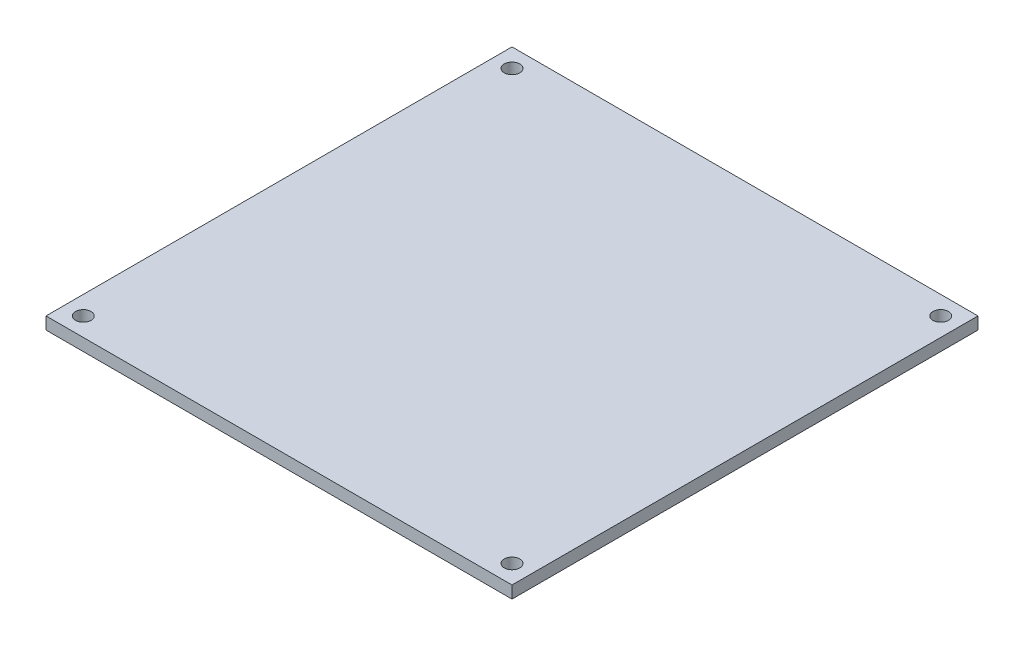
ISO-10303-21;
HEADER;
FILE_DESCRIPTION(('STEP AP214'),'2;1');
FILE_NAME('part.step','',(''),(''),'','','');
FILE_SCHEMA(('AUTOMOTIVE_DESIGN { 1 0 10303 214 1 1 1 1 }'));
ENDSEC;
DATA;
#1=APPLICATION_CONTEXT('core data for automotive mechanical design processes');
#2=APPLICATION_PROTOCOL_DEFINITION('international standard','automotive_design',2000,#1);
#3=PRODUCT_CONTEXT('',#1,'mechanical');
#4=PRODUCT('Part','Part','',(#3));
#5=PRODUCT_RELATED_PRODUCT_CATEGORY('part','',(#4));
#6=PRODUCT_DEFINITION_FORMATION('','',#4);
#7=PRODUCT_DEFINITION_CONTEXT('part definition',#1,'design');
#8=PRODUCT_DEFINITION('design','',#6,#7);
#9=PRODUCT_DEFINITION_SHAPE('','',#8);
#10=(LENGTH_UNIT() NAMED_UNIT(*) SI_UNIT(.MILLI.,.METRE.));
#11=(NAMED_UNIT(*) PLANE_ANGLE_UNIT() SI_UNIT($,.RADIAN.));
#12=(NAMED_UNIT(*) SI_UNIT($,.STERADIAN.) SOLID_ANGLE_UNIT());
#13=UNCERTAINTY_MEASURE_WITH_UNIT(LENGTH_MEASURE(1.E-05),#10,'distance_accuracy_value','');
#14=(GEOMETRIC_REPRESENTATION_CONTEXT(3) GLOBAL_UNCERTAINTY_ASSIGNED_CONTEXT((#13)) GLOBAL_UNIT_ASSIGNED_CONTEXT((#10,
#11,#12)) REPRESENTATION_CONTEXT('',''));
#15=CARTESIAN_POINT('',(0.,0.,0.));
#16=DIRECTION('',(0.,0.,1.));
#17=DIRECTION('',(1.,0.,0.));
#18=AXIS2_PLACEMENT_3D('',#15,#16,#17);
#19=CARTESIAN_POINT('',(0.,2.0066,0.));
#20=DIRECTION('',(0.,1.,0.));
#21=DIRECTION('',(0.,0.,1.));
#22=AXIS2_PLACEMENT_3D('',#19,#20,#21);
#23=PLANE('',#22);
#24=CARTESIAN_POINT('',(-35.052,2.0066,35.052));
#25=DIRECTION('',(0.,1.,0.));
#26=DIRECTION('',(0.,0.,1.));
#27=AXIS2_PLACEMENT_3D('',#24,#25,#26);
#28=CIRCLE('',#27,1.27);
#29=CARTESIAN_POINT('',(-35.052,2.0066,36.322));
#30=VERTEX_POINT('',#29);
#31=EDGE_CURVE('E147',#30,#30,#28,.T.);
#32=ORIENTED_EDGE('',*,*,#31,.F.);
#33=EDGE_LOOP('',(#32));
#34=FACE_BOUND('',#33,.T.);
#35=CARTESIAN_POINT('',(-35.052,2.0066,-35.052));
#36=DIRECTION('',(0.,1.,0.));
#37=DIRECTION('',(0.,0.,1.));
#38=AXIS2_PLACEMENT_3D('',#35,#36,#37);
#39=CIRCLE('',#38,1.27);
#40=CARTESIAN_POINT('',(-35.052,2.0066,-33.782));
#41=VERTEX_POINT('',#40);
#42=EDGE_CURVE('E117',#41,#41,#39,.T.);
#43=ORIENTED_EDGE('',*,*,#42,.F.);
#44=EDGE_LOOP('',(#43));
#45=FACE_BOUND('',#44,.T.);
#46=DIRECTION('',(0.,0.,1.));
#47=VECTOR('',#46,1.);
#48=CARTESIAN_POINT('',(-38.1,2.0066,38.1));
#49=LINE('',#48,#47);
#50=CARTESIAN_POINT('',(-38.1,2.0066,-38.1));
#51=VERTEX_POINT('',#50);
#52=CARTESIAN_POINT('',(-38.1,2.0066,38.1));
#53=VERTEX_POINT('',#52);
#54=EDGE_CURVE('E97',#51,#53,#49,.T.);
#55=ORIENTED_EDGE('',*,*,#54,.T.);
#56=DIRECTION('',(1.,0.,0.));
#57=VECTOR('',#56,1.);
#58=CARTESIAN_POINT('',(38.1,2.0066,38.1));
#59=LINE('',#58,#57);
#60=CARTESIAN_POINT('',(38.1,2.0066,38.1));
#61=VERTEX_POINT('',#60);
#62=EDGE_CURVE('E92',#53,#61,#59,.T.);
#63=ORIENTED_EDGE('',*,*,#62,.T.);
#64=DIRECTION('',(0.,0.,-1.));
#65=VECTOR('',#64,1.);
#66=CARTESIAN_POINT('',(38.1,2.0066,38.1));
#67=LINE('',#66,#65);
#68=CARTESIAN_POINT('',(38.1,2.0066,-38.1));
#69=VERTEX_POINT('',#68);
#70=EDGE_CURVE('E95',#61,#69,#67,.T.);
#71=ORIENTED_EDGE('',*,*,#70,.T.);
#72=DIRECTION('',(-1.,0.,0.));
#73=VECTOR('',#72,1.);
#74=CARTESIAN_POINT('',(38.1,2.0066,-38.1));
#75=LINE('',#74,#73);
#76=EDGE_CURVE('E62',#69,#51,#75,.T.);
#77=ORIENTED_EDGE('',*,*,#76,.T.);
#78=EDGE_LOOP('',(#55,#63,#71,#77));
#79=FACE_BOUND('',#78,.T.);
#80=CARTESIAN_POINT('',(35.052,2.0066,-35.052));
#81=DIRECTION('',(0.,1.,0.));
#82=DIRECTION('',(0.,0.,1.));
#83=AXIS2_PLACEMENT_3D('',#80,#81,#82);
#84=CIRCLE('',#83,1.27);
#85=CARTESIAN_POINT('',(35.052,2.0066,-33.782));
#86=VERTEX_POINT('',#85);
#87=EDGE_CURVE('E139',#86,#86,#84,.T.);
#88=ORIENTED_EDGE('',*,*,#87,.F.);
#89=EDGE_LOOP('',(#88));
#90=FACE_BOUND('',#89,.T.);
#91=CARTESIAN_POINT('',(35.052,2.0066,35.052));
#92=DIRECTION('',(0.,1.,0.));
#93=DIRECTION('',(0.,0.,1.));
#94=AXIS2_PLACEMENT_3D('',#91,#92,#93);
#95=CIRCLE('',#94,1.27);
#96=CARTESIAN_POINT('',(35.052,2.0066,36.322));
#97=VERTEX_POINT('',#96);
#98=EDGE_CURVE('E155',#97,#97,#95,.T.);
#99=ORIENTED_EDGE('',*,*,#98,.F.);
#100=EDGE_LOOP('',(#99));
#101=FACE_BOUND('',#100,.T.);
#102=ADVANCED_FACE('F44',(#34,#45,#79,#90,#101),#23,.T.);
#103=CARTESIAN_POINT('',(0.,0.,0.));
#104=DIRECTION('',(0.,1.,0.));
#105=DIRECTION('',(0.,0.,1.));
#106=AXIS2_PLACEMENT_3D('',#103,#104,#105);
#107=PLANE('',#106);
#108=DIRECTION('',(0.,0.,1.));
#109=VECTOR('',#108,1.);
#110=CARTESIAN_POINT('',(-38.1,0.,38.1));
#111=LINE('',#110,#109);
#112=CARTESIAN_POINT('',(-38.1,0.,-38.1));
#113=VERTEX_POINT('',#112);
#114=CARTESIAN_POINT('',(-38.1,0.,38.1));
#115=VERTEX_POINT('',#114);
#116=EDGE_CURVE('E113',#113,#115,#111,.T.);
#117=ORIENTED_EDGE('',*,*,#116,.F.);
#118=DIRECTION('',(-1.,0.,0.));
#119=VECTOR('',#118,1.);
#120=CARTESIAN_POINT('',(38.1,0.,-38.1));
#121=LINE('',#120,#119);
#122=CARTESIAN_POINT('',(38.1,0.,-38.1));
#123=VERTEX_POINT('',#122);
#124=EDGE_CURVE('E85',#123,#113,#121,.T.);
#125=ORIENTED_EDGE('',*,*,#124,.F.);
#126=DIRECTION('',(0.,0.,-1.));
#127=VECTOR('',#126,1.);
#128=CARTESIAN_POINT('',(38.1,0.,38.1));
#129=LINE('',#128,#127);
#130=CARTESIAN_POINT('',(38.1,0.,38.1));
#131=VERTEX_POINT('',#130);
#132=EDGE_CURVE('E79',#131,#123,#129,.T.);
#133=ORIENTED_EDGE('',*,*,#132,.F.);
#134=DIRECTION('',(1.,0.,0.));
#135=VECTOR('',#134,1.);
#136=CARTESIAN_POINT('',(38.1,0.,38.1));
#137=LINE('',#136,#135);
#138=EDGE_CURVE('E102',#115,#131,#137,.T.);
#139=ORIENTED_EDGE('',*,*,#138,.F.);
#140=EDGE_LOOP('',(#117,#125,#133,#139));
#141=FACE_BOUND('',#140,.T.);
#142=CARTESIAN_POINT('',(-35.052,0.,-35.052));
#143=DIRECTION('',(0.,1.,0.));
#144=DIRECTION('',(0.,0.,1.));
#145=AXIS2_PLACEMENT_3D('',#142,#143,#144);
#146=CIRCLE('',#145,1.27);
#147=CARTESIAN_POINT('',(-35.052,0.,-33.782));
#148=VERTEX_POINT('',#147);
#149=EDGE_CURVE('E135',#148,#148,#146,.T.);
#150=ORIENTED_EDGE('',*,*,#149,.T.);
#151=EDGE_LOOP('',(#150));
#152=FACE_BOUND('',#151,.T.);
#153=CARTESIAN_POINT('',(35.052,0.,-35.052));
#154=DIRECTION('',(0.,1.,0.));
#155=DIRECTION('',(0.,0.,1.));
#156=AXIS2_PLACEMENT_3D('',#153,#154,#155);
#157=CIRCLE('',#156,1.27);
#158=CARTESIAN_POINT('',(35.052,0.,-33.782));
#159=VERTEX_POINT('',#158);
#160=EDGE_CURVE('E143',#159,#159,#157,.T.);
#161=ORIENTED_EDGE('',*,*,#160,.T.);
#162=EDGE_LOOP('',(#161));
#163=FACE_BOUND('',#162,.T.);
#164=CARTESIAN_POINT('',(-35.052,0.,35.052));
#165=DIRECTION('',(0.,1.,0.));
#166=DIRECTION('',(0.,0.,1.));
#167=AXIS2_PLACEMENT_3D('',#164,#165,#166);
#168=CIRCLE('',#167,1.27);
#169=CARTESIAN_POINT('',(-35.052,0.,36.322));
#170=VERTEX_POINT('',#169);
#171=EDGE_CURVE('E151',#170,#170,#168,.T.);
#172=ORIENTED_EDGE('',*,*,#171,.T.);
#173=EDGE_LOOP('',(#172));
#174=FACE_BOUND('',#173,.T.);
#175=CARTESIAN_POINT('',(35.052,0.,35.052));
#176=DIRECTION('',(0.,1.,0.));
#177=DIRECTION('',(0.,0.,1.));
#178=AXIS2_PLACEMENT_3D('',#175,#176,#177);
#179=CIRCLE('',#178,1.27);
#180=CARTESIAN_POINT('',(35.052,0.,36.322));
#181=VERTEX_POINT('',#180);
#182=EDGE_CURVE('E159',#181,#181,#179,.T.);
#183=ORIENTED_EDGE('',*,*,#182,.T.);
#184=EDGE_LOOP('',(#183));
#185=FACE_BOUND('',#184,.T.);
#186=ADVANCED_FACE('F130',(#141,#152,#163,#174,#185),#107,.F.);
#187=CARTESIAN_POINT('',(-38.1,2.0066,38.1));
#188=DIRECTION('',(1.,0.,0.));
#189=DIRECTION('',(0.,0.,-1.));
#190=AXIS2_PLACEMENT_3D('',#187,#188,#189);
#191=PLANE('',#190);
#192=ORIENTED_EDGE('',*,*,#116,.T.);
#193=DIRECTION('',(0.,-1.,0.));
#194=VECTOR('',#193,1.);
#195=CARTESIAN_POINT('',(-38.1,2.0066,38.1));
#196=LINE('',#195,#194);
#197=EDGE_CURVE('E11',#53,#115,#196,.T.);
#198=ORIENTED_EDGE('',*,*,#197,.F.);
#199=ORIENTED_EDGE('',*,*,#54,.F.);
#200=DIRECTION('',(0.,-1.,0.));
#201=VECTOR('',#200,1.);
#202=CARTESIAN_POINT('',(-38.1,2.0066,-38.1));
#203=LINE('',#202,#201);
#204=EDGE_CURVE('E109',#51,#113,#203,.T.);
#205=ORIENTED_EDGE('',*,*,#204,.T.);
#206=EDGE_LOOP('',(#192,#198,#199,#205));
#207=FACE_BOUND('',#206,.T.);
#208=ADVANCED_FACE('F46',(#207),#191,.F.);
#209=CARTESIAN_POINT('',(38.1,2.0066,38.1));
#210=DIRECTION('',(0.,0.,-1.));
#211=DIRECTION('',(-1.,0.,0.));
#212=AXIS2_PLACEMENT_3D('',#209,#210,#211);
#213=PLANE('',#212);
#214=ORIENTED_EDGE('',*,*,#138,.T.);
#215=DIRECTION('',(0.,-1.,0.));
#216=VECTOR('',#215,1.);
#217=CARTESIAN_POINT('',(38.1,2.0066,38.1));
#218=LINE('',#217,#216);
#219=EDGE_CURVE('E54',#61,#131,#218,.T.);
#220=ORIENTED_EDGE('',*,*,#219,.F.);
#221=ORIENTED_EDGE('',*,*,#62,.F.);
#222=ORIENTED_EDGE('',*,*,#197,.T.);
#223=EDGE_LOOP('',(#214,#220,#221,#222));
#224=FACE_BOUND('',#223,.T.);
#225=ADVANCED_FACE('F101',(#224),#213,.F.);
#226=CARTESIAN_POINT('',(38.1,2.0066,38.1));
#227=DIRECTION('',(-1.,0.,0.));
#228=DIRECTION('',(0.,0.,1.));
#229=AXIS2_PLACEMENT_3D('',#226,#227,#228);
#230=PLANE('',#229);
#231=ORIENTED_EDGE('',*,*,#132,.T.);
#232=DIRECTION('',(0.,-1.,0.));
#233=VECTOR('',#232,1.);
#234=CARTESIAN_POINT('',(38.1,2.0066,-38.1));
#235=LINE('',#234,#233);
#236=EDGE_CURVE('E104',#69,#123,#235,.T.);
#237=ORIENTED_EDGE('',*,*,#236,.F.);
#238=ORIENTED_EDGE('',*,*,#70,.F.);
#239=ORIENTED_EDGE('',*,*,#219,.T.);
#240=EDGE_LOOP('',(#231,#237,#238,#239));
#241=FACE_BOUND('',#240,.T.);
#242=ADVANCED_FACE('F105',(#241),#230,.F.);
#243=CARTESIAN_POINT('',(38.1,2.0066,-38.1));
#244=DIRECTION('',(0.,0.,1.));
#245=DIRECTION('',(1.,0.,0.));
#246=AXIS2_PLACEMENT_3D('',#243,#244,#245);
#247=PLANE('',#246);
#248=ORIENTED_EDGE('',*,*,#124,.T.);
#249=ORIENTED_EDGE('',*,*,#204,.F.);
#250=ORIENTED_EDGE('',*,*,#76,.F.);
#251=ORIENTED_EDGE('',*,*,#236,.T.);
#252=EDGE_LOOP('',(#248,#249,#250,#251));
#253=FACE_BOUND('',#252,.T.);
#254=ADVANCED_FACE('F127',(#253),#247,.F.);
#255=CARTESIAN_POINT('',(-35.052,2.0066,-35.052));
#256=DIRECTION('',(0.,-1.,0.));
#257=DIRECTION('',(0.,0.,-1.));
#258=AXIS2_PLACEMENT_3D('',#255,#256,#257);
#259=CYLINDRICAL_SURFACE('',#258,1.27);
#260=ORIENTED_EDGE('',*,*,#42,.T.);
#261=EDGE_LOOP('',(#260));
#262=FACE_BOUND('',#261,.T.);
#263=ORIENTED_EDGE('',*,*,#149,.F.);
#264=EDGE_LOOP('',(#263));
#265=FACE_BOUND('',#264,.T.);
#266=ADVANCED_FACE('F180',(#262,#265),#259,.F.);
#267=CARTESIAN_POINT('',(35.052,2.0066,-35.052));
#268=DIRECTION('',(0.,-1.,0.));
#269=DIRECTION('',(0.,0.,-1.));
#270=AXIS2_PLACEMENT_3D('',#267,#268,#269);
#271=CYLINDRICAL_SURFACE('',#270,1.27);
#272=ORIENTED_EDGE('',*,*,#87,.T.);
#273=EDGE_LOOP('',(#272));
#274=FACE_BOUND('',#273,.T.);
#275=ORIENTED_EDGE('',*,*,#160,.F.);
#276=EDGE_LOOP('',(#275));
#277=FACE_BOUND('',#276,.T.);
#278=ADVANCED_FACE('F225',(#274,#277),#271,.F.);
#279=CARTESIAN_POINT('',(-35.052,2.0066,35.052));
#280=DIRECTION('',(0.,-1.,0.));
#281=DIRECTION('',(0.,0.,-1.));
#282=AXIS2_PLACEMENT_3D('',#279,#280,#281);
#283=CYLINDRICAL_SURFACE('',#282,1.27);
#284=ORIENTED_EDGE('',*,*,#31,.T.);
#285=EDGE_LOOP('',(#284));
#286=FACE_BOUND('',#285,.T.);
#287=ORIENTED_EDGE('',*,*,#171,.F.);
#288=EDGE_LOOP('',(#287));
#289=FACE_BOUND('',#288,.T.);
#290=ADVANCED_FACE('F233',(#286,#289),#283,.F.);
#291=CARTESIAN_POINT('',(35.052,2.0066,35.052));
#292=DIRECTION('',(0.,-1.,0.));
#293=DIRECTION('',(0.,0.,-1.));
#294=AXIS2_PLACEMENT_3D('',#291,#292,#293);
#295=CYLINDRICAL_SURFACE('',#294,1.27);
#296=ORIENTED_EDGE('',*,*,#98,.T.);
#297=EDGE_LOOP('',(#296));
#298=FACE_BOUND('',#297,.T.);
#299=ORIENTED_EDGE('',*,*,#182,.F.);
#300=EDGE_LOOP('',(#299));
#301=FACE_BOUND('',#300,.T.);
#302=ADVANCED_FACE('F167',(#298,#301),#295,.F.);
#303=CLOSED_SHELL('',(#102,#186,#208,#225,#242,#254,#266,#278,#290,#302));
#304=MANIFOLD_SOLID_BREP('B2',#303);
#305=ADVANCED_BREP_SHAPE_REPRESENTATION('',(#18,#304),#14);
#306=SHAPE_DEFINITION_REPRESENTATION(#9,#305);
ENDSEC;
END-ISO-10303-21;
